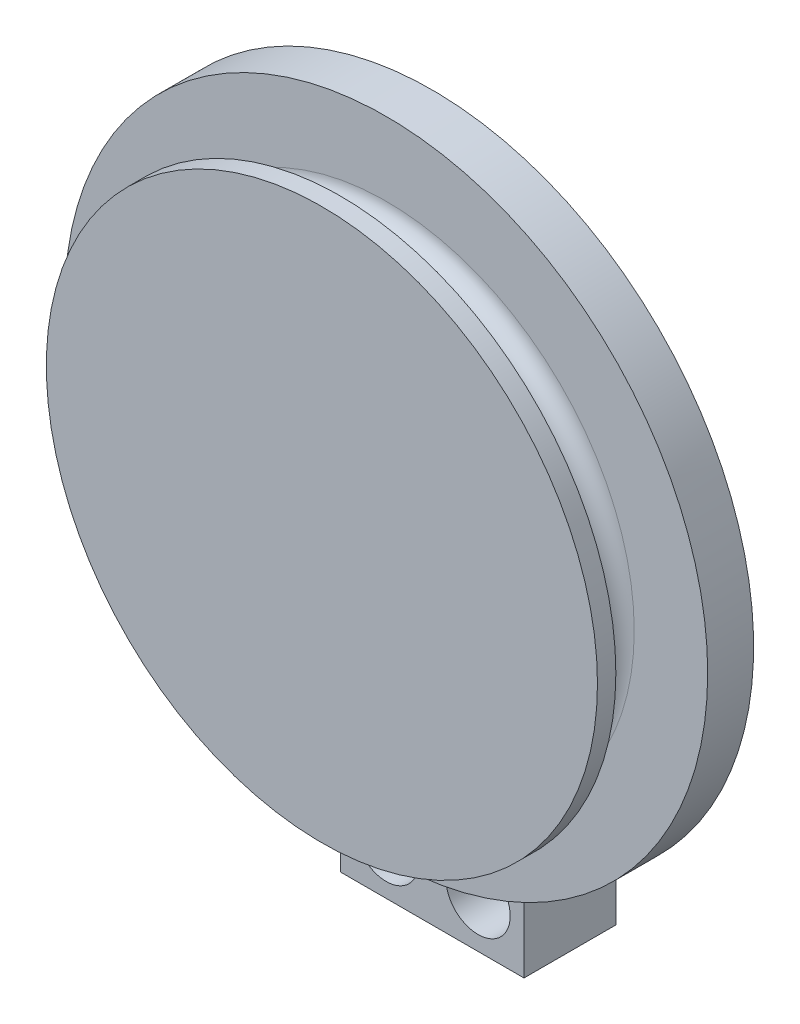
ISO-10303-21;
HEADER;
FILE_DESCRIPTION(('STEP AP214'),'2;1');
FILE_NAME('part.step','',(''),(''),'','','');
FILE_SCHEMA(('AUTOMOTIVE_DESIGN { 1 0 10303 214 1 1 1 1 }'));
ENDSEC;
DATA;
#1=APPLICATION_CONTEXT('core data for automotive mechanical design processes');
#2=APPLICATION_PROTOCOL_DEFINITION('international standard','automotive_design',2000,#1);
#3=PRODUCT_CONTEXT('',#1,'mechanical');
#4=PRODUCT('Part','Part','',(#3));
#5=PRODUCT_RELATED_PRODUCT_CATEGORY('part','',(#4));
#6=PRODUCT_DEFINITION_FORMATION('','',#4);
#7=PRODUCT_DEFINITION_CONTEXT('part definition',#1,'design');
#8=PRODUCT_DEFINITION('design','',#6,#7);
#9=PRODUCT_DEFINITION_SHAPE('','',#8);
#10=(LENGTH_UNIT() NAMED_UNIT(*) SI_UNIT(.MILLI.,.METRE.));
#11=(NAMED_UNIT(*) PLANE_ANGLE_UNIT() SI_UNIT($,.RADIAN.));
#12=(NAMED_UNIT(*) SI_UNIT($,.STERADIAN.) SOLID_ANGLE_UNIT());
#13=UNCERTAINTY_MEASURE_WITH_UNIT(LENGTH_MEASURE(1.E-05),#10,'distance_accuracy_value','');
#14=(GEOMETRIC_REPRESENTATION_CONTEXT(3) GLOBAL_UNCERTAINTY_ASSIGNED_CONTEXT((#13)) GLOBAL_UNIT_ASSIGNED_CONTEXT((#10,
#11,#12)) REPRESENTATION_CONTEXT('',''));
#15=CARTESIAN_POINT('',(0.,0.,0.));
#16=DIRECTION('',(0.,0.,1.));
#17=DIRECTION('',(1.,0.,0.));
#18=AXIS2_PLACEMENT_3D('',#15,#16,#17);
#19=CARTESIAN_POINT('',(-5.,-38.6381772685362,21.));
#20=DIRECTION('',(0.,0.,-1.));
#21=DIRECTION('',(-1.,0.,0.));
#22=AXIS2_PLACEMENT_3D('',#19,#20,#21);
#23=CYLINDRICAL_SURFACE('',#22,1.75);
#24=CARTESIAN_POINT('',(-5.,-38.6381772685362,-1.));
#25=DIRECTION('',(0.,0.,-1.));
#26=DIRECTION('',(-1.,0.,0.));
#27=AXIS2_PLACEMENT_3D('',#24,#25,#26);
#28=CIRCLE('',#27,1.75);
#29=CARTESIAN_POINT('',(-6.75,-38.6381772685362,-1.));
#30=VERTEX_POINT('',#29);
#31=EDGE_CURVE('E313',#30,#30,#28,.T.);
#32=ORIENTED_EDGE('',*,*,#31,.T.);
#33=EDGE_LOOP('',(#32));
#34=FACE_BOUND('',#33,.T.);
#35=CARTESIAN_POINT('',(-5.,-38.6381772685362,3.));
#36=DIRECTION('',(0.,0.,1.));
#37=DIRECTION('',(1.,0.,0.));
#38=AXIS2_PLACEMENT_3D('',#35,#36,#37);
#39=CIRCLE('',#38,1.75);
#40=CARTESIAN_POINT('',(-3.25,-38.6381772685362,3.));
#41=VERTEX_POINT('',#40);
#42=EDGE_CURVE('E38',#41,#41,#39,.F.);
#43=ORIENTED_EDGE('',*,*,#42,.F.);
#44=EDGE_LOOP('',(#43));
#45=FACE_BOUND('',#44,.T.);
#46=ADVANCED_FACE('F33',(#34,#45),#23,.F.);
#47=CARTESIAN_POINT('',(5.,-38.6381772685362,21.));
#48=DIRECTION('',(0.,0.,-1.));
#49=DIRECTION('',(-1.,0.,0.));
#50=AXIS2_PLACEMENT_3D('',#47,#48,#49);
#51=CYLINDRICAL_SURFACE('',#50,1.75);
#52=CARTESIAN_POINT('',(5.,-38.6381772685362,-1.));
#53=DIRECTION('',(0.,0.,-1.));
#54=DIRECTION('',(-1.,0.,0.));
#55=AXIS2_PLACEMENT_3D('',#52,#53,#54);
#56=CIRCLE('',#55,1.75);
#57=CARTESIAN_POINT('',(3.25,-38.6381772685362,-1.));
#58=VERTEX_POINT('',#57);
#59=EDGE_CURVE('E358',#58,#58,#56,.T.);
#60=ORIENTED_EDGE('',*,*,#59,.T.);
#61=EDGE_LOOP('',(#60));
#62=FACE_BOUND('',#61,.T.);
#63=CARTESIAN_POINT('',(5.,-38.6381772685362,3.));
#64=DIRECTION('',(0.,0.,1.));
#65=DIRECTION('',(1.,0.,0.));
#66=AXIS2_PLACEMENT_3D('',#63,#64,#65);
#67=CIRCLE('',#66,1.75);
#68=CARTESIAN_POINT('',(6.75,-38.6381772685362,3.));
#69=VERTEX_POINT('',#68);
#70=EDGE_CURVE('E325',#69,#69,#67,.F.);
#71=ORIENTED_EDGE('',*,*,#70,.F.);
#72=EDGE_LOOP('',(#71));
#73=FACE_BOUND('',#72,.T.);
#74=ADVANCED_FACE('F242',(#62,#73),#51,.F.);
#75=CARTESIAN_POINT('',(0.,0.,9.));
#76=DIRECTION('',(0.,0.,1.));
#77=DIRECTION('',(1.,0.,0.));
#78=AXIS2_PLACEMENT_3D('',#75,#76,#77);
#79=PLANE('',#78);
#80=CARTESIAN_POINT('',(0.,0.,9.));
#81=DIRECTION('',(0.,0.,1.));
#82=DIRECTION('',(1.,0.,0.));
#83=AXIS2_PLACEMENT_3D('',#80,#81,#82);
#84=CIRCLE('',#83,6.25);
#85=CARTESIAN_POINT('',(6.25,0.,9.));
#86=VERTEX_POINT('',#85);
#87=EDGE_CURVE('E378',#86,#86,#84,.T.);
#88=ORIENTED_EDGE('',*,*,#87,.T.);
#89=EDGE_LOOP('',(#88));
#90=FACE_BOUND('',#89,.T.);
#91=DIRECTION('',(1.,0.,0.));
#92=VECTOR('',#91,1.);
#93=CARTESIAN_POINT('',(-35.,0.,9.));
#94=LINE('',#93,#92);
#95=CARTESIAN_POINT('',(-35.,0.,9.));
#96=VERTEX_POINT('',#95);
#97=CARTESIAN_POINT('',(-27.,0.,9.));
#98=VERTEX_POINT('',#97);
#99=EDGE_CURVE('E293',#96,#98,#94,.T.);
#100=ORIENTED_EDGE('',*,*,#99,.F.);
#101=CARTESIAN_POINT('',(0.,0.,9.));
#102=DIRECTION('',(0.,0.,1.));
#103=DIRECTION('',(1.,0.,0.));
#104=AXIS2_PLACEMENT_3D('',#101,#102,#103);
#105=CIRCLE('',#104,35.);
#106=CARTESIAN_POINT('',(10.,-33.5410196624969,9.));
#107=VERTEX_POINT('',#106);
#108=EDGE_CURVE('E138',#107,#96,#105,.T.);
#109=ORIENTED_EDGE('',*,*,#108,.F.);
#110=DIRECTION('',(0.,-1.,0.));
#111=VECTOR('',#110,1.);
#112=CARTESIAN_POINT('',(10.,-25.0798724079689,9.));
#113=LINE('',#112,#111);
#114=CARTESIAN_POINT('',(10.,-25.0798724079689,9.));
#115=VERTEX_POINT('',#114);
#116=EDGE_CURVE('E56',#115,#107,#113,.T.);
#117=ORIENTED_EDGE('',*,*,#116,.F.);
#118=CARTESIAN_POINT('',(0.,0.,9.));
#119=DIRECTION('',(0.,0.,1.));
#120=DIRECTION('',(-1.,0.,0.));
#121=AXIS2_PLACEMENT_3D('',#118,#119,#120);
#122=CIRCLE('',#121,27.);
#123=EDGE_CURVE('E51',#98,#115,#122,.T.);
#124=ORIENTED_EDGE('',*,*,#123,.F.);
#125=EDGE_LOOP('',(#100,#109,#117,#124));
#126=FACE_BOUND('',#125,.T.);
#127=ADVANCED_FACE('F240',(#90,#126),#79,.F.);
#128=CARTESIAN_POINT('',(0.,0.,19.));
#129=DIRECTION('',(0.,0.,-1.));
#130=DIRECTION('',(-1.,0.,0.));
#131=AXIS2_PLACEMENT_3D('',#128,#129,#130);
#132=CYLINDRICAL_SURFACE('',#131,25.);
#133=CARTESIAN_POINT('',(0.,0.,17.));
#134=DIRECTION('',(0.,0.,1.));
#135=DIRECTION('',(1.,0.,0.));
#136=AXIS2_PLACEMENT_3D('',#133,#134,#135);
#137=CIRCLE('',#136,25.);
#138=CARTESIAN_POINT('',(1.42285988544555,24.9594765519309,17.));
#139=VERTEX_POINT('',#138);
#140=CARTESIAN_POINT('',(1.42285988544555,-24.9594765519309,17.));
#141=VERTEX_POINT('',#140);
#142=EDGE_CURVE('E393',#139,#141,#137,.F.);
#143=ORIENTED_EDGE('',*,*,#142,.T.);
#144=CARTESIAN_POINT('',(1.42285988544555,-24.9594765519309,17.));
#145=CARTESIAN_POINT('',(1.43709694327065,-24.9586644030287,16.9597341039124));
#146=CARTESIAN_POINT('',(1.44960646372834,-24.9579396577293,16.9188748216169));
#147=CARTESIAN_POINT('',(1.47109830540468,-24.9566822846817,16.836239768369));
#148=CARTESIAN_POINT('',(1.48008092678776,-24.9561496405848,16.7944640757293));
#149=CARTESIAN_POINT('',(1.50122110227948,-24.9548902014337,16.6705739593089));
#150=CARTESIAN_POINT('',(1.5083903417906,-24.9544536508322,16.5875537152397));
#151=CARTESIAN_POINT('',(1.50889312423618,-24.9544233205322,16.4200067063181));
#152=CARTESIAN_POINT('',(1.50198164799829,-24.9548444655901,16.3354790719246));
#153=CARTESIAN_POINT('',(1.48085640756052,-24.9561036179267,16.2093215945543));
#154=CARTESIAN_POINT('',(1.47180930042457,-24.9566404247026,16.1667673690737));
#155=CARTESIAN_POINT('',(1.45005847503599,-24.9579134519568,16.0826040156588));
#156=CARTESIAN_POINT('',(1.43735452318072,-24.9586496851745,16.0409949482853));
#157=CARTESIAN_POINT('',(1.42285988544555,-24.9594765519309,16.));
#158=B_SPLINE_CURVE_WITH_KNOTS('',3,(#144,#145,#146,#147,#148,#149,#150,#151,#152,#153,#154,
#155,#156,#157),.UNSPECIFIED.,.F.,.F.,(4,2,2,2,2,2,4),(0.,0.128074424957378,0.256137947498022,
0.504914091980192,0.758056161619229,0.888437062160874,1.01882629340442),.UNSPECIFIED.);
#159=CARTESIAN_POINT('',(1.42285988544555,-24.9594765519309,16.));
#160=VERTEX_POINT('',#159);
#161=EDGE_CURVE('E142',#141,#160,#158,.T.);
#162=ORIENTED_EDGE('',*,*,#161,.T.);
#163=CARTESIAN_POINT('',(0.,0.,16.));
#164=DIRECTION('',(0.,0.,1.));
#165=DIRECTION('',(1.,0.,0.));
#166=AXIS2_PLACEMENT_3D('',#163,#164,#165);
#167=CIRCLE('',#166,25.);
#168=CARTESIAN_POINT('',(1.42285988544555,24.9594765519309,16.));
#169=VERTEX_POINT('',#168);
#170=EDGE_CURVE('E397',#160,#169,#167,.T.);
#171=ORIENTED_EDGE('',*,*,#170,.T.);
#172=CARTESIAN_POINT('',(1.42285988544555,24.9594765519309,16.));
#173=CARTESIAN_POINT('',(1.43709694327065,24.9586644030287,16.0402658960876));
#174=CARTESIAN_POINT('',(1.44960646372834,24.9579396577293,16.0811251783831));
#175=CARTESIAN_POINT('',(1.47109830540468,24.9566822846817,16.163760231631));
#176=CARTESIAN_POINT('',(1.48008092678776,24.9561496405848,16.2055359242707));
#177=CARTESIAN_POINT('',(1.50122110227948,24.9548902014337,16.3294260406911));
#178=CARTESIAN_POINT('',(1.5083903417906,24.9544536508322,16.4124462847603));
#179=CARTESIAN_POINT('',(1.50889312423618,24.9544233205322,16.5799932936819));
#180=CARTESIAN_POINT('',(1.50198164799829,24.9548444655901,16.6645209280754));
#181=CARTESIAN_POINT('',(1.48085640756052,24.9561036179267,16.7906784054457));
#182=CARTESIAN_POINT('',(1.47180930042457,24.9566404247026,16.8332326309263));
#183=CARTESIAN_POINT('',(1.45005847503599,24.9579134519568,16.9173959843412));
#184=CARTESIAN_POINT('',(1.43735452318072,24.9586496851745,16.9590050517147));
#185=CARTESIAN_POINT('',(1.42285988544555,24.9594765519309,17.));
#186=B_SPLINE_CURVE_WITH_KNOTS('',3,(#172,#173,#174,#175,#176,#177,#178,#179,#180,#181,#182,
#183,#184,#185),.UNSPECIFIED.,.F.,.F.,(4,2,2,2,2,2,4),(0.,0.128074424957378,0.256137947498022,
0.504914091980192,0.758056161619229,0.888437062160874,1.01882629340442),.UNSPECIFIED.);
#187=EDGE_CURVE('E193',#169,#139,#186,.T.);
#188=ORIENTED_EDGE('',*,*,#187,.T.);
#189=EDGE_LOOP('',(#143,#162,#171,#188));
#190=FACE_BOUND('',#189,.T.);
#191=ADVANCED_FACE('F223',(#190),#132,.T.);
#192=CARTESIAN_POINT('',(0.,0.,7.));
#193=DIRECTION('',(0.,0.,-1.));
#194=DIRECTION('',(-1.,0.,0.));
#195=AXIS2_PLACEMENT_3D('',#192,#193,#194);
#196=CYLINDRICAL_SURFACE('',#195,4.1);
#197=CARTESIAN_POINT('',(0.,0.,7.));
#198=DIRECTION('',(0.,0.,1.));
#199=DIRECTION('',(1.,0.,0.));
#200=AXIS2_PLACEMENT_3D('',#197,#198,#199);
#201=CIRCLE('',#200,4.1);
#202=CARTESIAN_POINT('',(4.1,0.,7.));
#203=VERTEX_POINT('',#202);
#204=EDGE_CURVE('E385',#203,#203,#201,.T.);
#205=ORIENTED_EDGE('',*,*,#204,.F.);
#206=EDGE_LOOP('',(#205));
#207=FACE_BOUND('',#206,.T.);
#208=CARTESIAN_POINT('',(0.,0.,0.));
#209=DIRECTION('',(0.,0.,1.));
#210=DIRECTION('',(1.,0.,0.));
#211=AXIS2_PLACEMENT_3D('',#208,#209,#210);
#212=CIRCLE('',#211,4.1);
#213=CARTESIAN_POINT('',(4.1,0.,0.));
#214=VERTEX_POINT('',#213);
#215=EDGE_CURVE('E381',#214,#214,#212,.T.);
#216=ORIENTED_EDGE('',*,*,#215,.T.);
#217=EDGE_LOOP('',(#216));
#218=FACE_BOUND('',#217,.T.);
#219=ADVANCED_FACE('F218',(#207,#218),#196,.T.);
#220=CARTESIAN_POINT('',(0.,0.,0.));
#221=DIRECTION('',(0.,0.,1.));
#222=DIRECTION('',(1.,0.,0.));
#223=AXIS2_PLACEMENT_3D('',#220,#221,#222);
#224=PLANE('',#223);
#225=ORIENTED_EDGE('',*,*,#215,.F.);
#226=EDGE_LOOP('',(#225));
#227=FACE_BOUND('',#226,.T.);
#228=ADVANCED_FACE('F222',(#227),#224,.F.);
#229=CARTESIAN_POINT('',(0.,0.,9.));
#230=DIRECTION('',(0.,0.,-1.));
#231=DIRECTION('',(-1.,0.,0.));
#232=AXIS2_PLACEMENT_3D('',#229,#230,#231);
#233=CYLINDRICAL_SURFACE('',#232,6.25);
#234=ORIENTED_EDGE('',*,*,#87,.F.);
#235=EDGE_LOOP('',(#234));
#236=FACE_BOUND('',#235,.T.);
#237=CARTESIAN_POINT('',(0.,0.,7.));
#238=DIRECTION('',(0.,0.,1.));
#239=DIRECTION('',(1.,0.,0.));
#240=AXIS2_PLACEMENT_3D('',#237,#238,#239);
#241=CIRCLE('',#240,6.25);
#242=CARTESIAN_POINT('',(6.25,0.,7.));
#243=VERTEX_POINT('',#242);
#244=EDGE_CURVE('E382',#243,#243,#241,.T.);
#245=ORIENTED_EDGE('',*,*,#244,.T.);
#246=EDGE_LOOP('',(#245));
#247=FACE_BOUND('',#246,.T.);
#248=ADVANCED_FACE('F227',(#236,#247),#233,.T.);
#249=CARTESIAN_POINT('',(0.,0.,7.));
#250=DIRECTION('',(0.,0.,1.));
#251=DIRECTION('',(1.,0.,0.));
#252=AXIS2_PLACEMENT_3D('',#249,#250,#251);
#253=PLANE('',#252);
#254=ORIENTED_EDGE('',*,*,#204,.T.);
#255=EDGE_LOOP('',(#254));
#256=FACE_BOUND('',#255,.T.);
#257=ORIENTED_EDGE('',*,*,#244,.F.);
#258=EDGE_LOOP('',(#257));
#259=FACE_BOUND('',#258,.T.);
#260=ADVANCED_FACE('F231',(#256,#259),#253,.F.);
#261=CARTESIAN_POINT('',(0.,0.,14.));
#262=DIRECTION('',(0.,0.,-1.));
#263=DIRECTION('',(-1.,0.,0.));
#264=AXIS2_PLACEMENT_3D('',#261,#262,#263);
#265=CYLINDRICAL_SURFACE('',#264,35.);
#266=CARTESIAN_POINT('',(0.,0.,14.));
#267=DIRECTION('',(0.,0.,1.));
#268=DIRECTION('',(1.,0.,0.));
#269=AXIS2_PLACEMENT_3D('',#266,#267,#268);
#270=CIRCLE('',#269,35.);
#271=CARTESIAN_POINT('',(35.,0.,14.));
#272=VERTEX_POINT('',#271);
#273=EDGE_CURVE('E373',#272,#272,#270,.T.);
#274=ORIENTED_EDGE('',*,*,#273,.F.);
#275=EDGE_LOOP('',(#274));
#276=FACE_BOUND('',#275,.T.);
#277=ORIENTED_EDGE('',*,*,#108,.T.);
#278=DIRECTION('',(0.,0.,1.));
#279=VECTOR('',#278,1.);
#280=CARTESIAN_POINT('',(-35.,0.,-0.999999999999999));
#281=LINE('',#280,#279);
#282=CARTESIAN_POINT('',(-35.,0.,-0.999999999999999));
#283=VERTEX_POINT('',#282);
#284=EDGE_CURVE('E119',#283,#96,#281,.T.);
#285=ORIENTED_EDGE('',*,*,#284,.F.);
#286=CARTESIAN_POINT('',(0.,0.,-0.999999999999999));
#287=DIRECTION('',(0.,0.,-1.));
#288=DIRECTION('',(-1.,0.,0.));
#289=AXIS2_PLACEMENT_3D('',#286,#287,#288);
#290=CIRCLE('',#289,35.);
#291=CARTESIAN_POINT('',(-10.,-33.5410196624969,-0.999999999999999));
#292=VERTEX_POINT('',#291);
#293=EDGE_CURVE('E125',#292,#283,#290,.T.);
#294=ORIENTED_EDGE('',*,*,#293,.F.);
#295=DIRECTION('',(0.,0.,1.));
#296=VECTOR('',#295,1.);
#297=CARTESIAN_POINT('',(-10.,-33.5410196624969,-0.999999999999999));
#298=LINE('',#297,#296);
#299=CARTESIAN_POINT('',(-10.,-33.5410196624969,9.));
#300=VERTEX_POINT('',#299);
#301=EDGE_CURVE('E304',#292,#300,#298,.T.);
#302=ORIENTED_EDGE('',*,*,#301,.T.);
#303=EDGE_CURVE('E370',#300,#107,#105,.T.);
#304=ORIENTED_EDGE('',*,*,#303,.T.);
#305=EDGE_LOOP('',(#277,#285,#294,#302,#304));
#306=FACE_BOUND('',#305,.T.);
#307=ADVANCED_FACE('F137',(#276,#306),#265,.T.);
#308=CARTESIAN_POINT('',(0.,0.,14.));
#309=DIRECTION('',(0.,0.,1.));
#310=DIRECTION('',(1.,0.,0.));
#311=AXIS2_PLACEMENT_3D('',#308,#309,#310);
#312=PLANE('',#311);
#313=CARTESIAN_POINT('',(0.,0.,14.));
#314=DIRECTION('',(0.,0.,1.));
#315=DIRECTION('',(1.,0.,0.));
#316=AXIS2_PLACEMENT_3D('',#313,#314,#315);
#317=CIRCLE('',#316,27.);
#318=CARTESIAN_POINT('',(27.,0.,14.));
#319=VERTEX_POINT('',#318);
#320=EDGE_CURVE('E400',#319,#319,#317,.F.);
#321=ORIENTED_EDGE('',*,*,#320,.T.);
#322=EDGE_LOOP('',(#321));
#323=FACE_BOUND('',#322,.T.);
#324=ORIENTED_EDGE('',*,*,#273,.T.);
#325=EDGE_LOOP('',(#324));
#326=FACE_BOUND('',#325,.T.);
#327=ADVANCED_FACE('F238',(#323,#326),#312,.T.);
#328=CARTESIAN_POINT('',(-1.40556723930064,-24.9604563406963,17.));
#329=VERTEX_POINT('',#328);
#330=CARTESIAN_POINT('',(-1.40556723930064,24.9604563406963,17.));
#331=VERTEX_POINT('',#330);
#332=EDGE_CURVE('E396',#329,#331,#137,.F.);
#333=ORIENTED_EDGE('',*,*,#332,.T.);
#334=CARTESIAN_POINT('',(-1.40556723930064,24.9604563406963,17.));
#335=CARTESIAN_POINT('',(-1.41980487103239,24.9596540547445,16.9597324779812));
#336=CARTESIAN_POINT('',(-1.43231481261331,24.9589379808545,16.9188715652109));
#337=CARTESIAN_POINT('',(-1.45380720366565,24.957695516502,16.8362332605887));
#338=CARTESIAN_POINT('',(-1.462789953484,24.9571691098893,16.7944559470899));
#339=CARTESIAN_POINT('',(-1.48393011300849,24.9559243701601,16.6705610014197));
#340=CARTESIAN_POINT('',(-1.49109880562506,24.9554928381129,16.5875375797939));
#341=CARTESIAN_POINT('',(-1.49159944617271,24.9554629851869,16.419990630566));
#342=CARTESIAN_POINT('',(-1.48468741844627,24.9558793558143,16.3354662408866));
#343=CARTESIAN_POINT('',(-1.46356213000763,24.9571238202395,16.2093135944511));
#344=CARTESIAN_POINT('',(-1.45451516963702,24.9576543270809,16.1667610666979));
#345=CARTESIAN_POINT('',(-1.43276489879871,24.9589121995704,16.0826009742226));
#346=CARTESIAN_POINT('',(-1.42006135424305,24.9596395778217,16.0409934701832));
#347=CARTESIAN_POINT('',(-1.40556723930065,24.9604563406963,16.));
#348=B_SPLINE_CURVE_WITH_KNOTS('',3,(#334,#335,#336,#337,#338,#339,#340,#341,#342,#343,#344,
#345,#346,#347),.UNSPECIFIED.,.F.,.F.,(4,2,2,2,2,2,4),(0.,0.128079028371411,0.256147148209057,
0.504932513805586,0.758065216469923,0.888440837240595,1.01882480628174),.UNSPECIFIED.);
#349=CARTESIAN_POINT('',(-1.40556723930064,24.9604563406963,16.));
#350=VERTEX_POINT('',#349);
#351=EDGE_CURVE('E198',#331,#350,#348,.T.);
#352=ORIENTED_EDGE('',*,*,#351,.T.);
#353=CARTESIAN_POINT('',(-1.40556723930064,-24.9604563406963,16.));
#354=VERTEX_POINT('',#353);
#355=EDGE_CURVE('E399',#350,#354,#167,.T.);
#356=ORIENTED_EDGE('',*,*,#355,.T.);
#357=CARTESIAN_POINT('',(-1.40556723930064,-24.9604563406963,16.));
#358=CARTESIAN_POINT('',(-1.41980487103239,-24.9596540547445,16.0402675220188));
#359=CARTESIAN_POINT('',(-1.43231481261331,-24.9589379808545,16.0811284347891));
#360=CARTESIAN_POINT('',(-1.45380720366565,-24.957695516502,16.1637667394113));
#361=CARTESIAN_POINT('',(-1.462789953484,-24.9571691098893,16.2055440529101));
#362=CARTESIAN_POINT('',(-1.48393011300849,-24.9559243701601,16.3294389985803));
#363=CARTESIAN_POINT('',(-1.49109880562506,-24.9554928381129,16.4124624202061));
#364=CARTESIAN_POINT('',(-1.49159944617271,-24.9554629851869,16.580009369434));
#365=CARTESIAN_POINT('',(-1.48468741844627,-24.9558793558143,16.6645337591134));
#366=CARTESIAN_POINT('',(-1.46356213000763,-24.9571238202395,16.7906864055489));
#367=CARTESIAN_POINT('',(-1.45451516963702,-24.9576543270809,16.8332389333021));
#368=CARTESIAN_POINT('',(-1.43276489879871,-24.9589121995704,16.9173990257774));
#369=CARTESIAN_POINT('',(-1.42006135424305,-24.9596395778217,16.9590065298168));
#370=CARTESIAN_POINT('',(-1.40556723930065,-24.9604563406963,17.));
#371=B_SPLINE_CURVE_WITH_KNOTS('',3,(#357,#358,#359,#360,#361,#362,#363,#364,#365,#366,#367,
#368,#369,#370),.UNSPECIFIED.,.F.,.F.,(4,2,2,2,2,2,4),(0.,0.128079028371411,0.256147148209057,
0.504932513805586,0.758065216469923,0.888440837240595,1.01882480628174),.UNSPECIFIED.);
#372=EDGE_CURVE('E139',#354,#329,#371,.T.);
#373=ORIENTED_EDGE('',*,*,#372,.T.);
#374=EDGE_LOOP('',(#333,#352,#356,#373));
#375=FACE_BOUND('',#374,.T.);
#376=ADVANCED_FACE('F157',(#375),#132,.T.);
#377=CARTESIAN_POINT('',(0.,0.,21.));
#378=DIRECTION('',(0.,0.,-1.));
#379=DIRECTION('',(-1.,0.,0.));
#380=AXIS2_PLACEMENT_3D('',#377,#378,#379);
#381=CYLINDRICAL_SURFACE('',#380,30.);
#382=CARTESIAN_POINT('',(0.,0.,21.));
#383=DIRECTION('',(0.,0.,1.));
#384=DIRECTION('',(1.,0.,0.));
#385=AXIS2_PLACEMENT_3D('',#382,#383,#384);
#386=CIRCLE('',#385,30.);
#387=CARTESIAN_POINT('',(30.,0.,21.));
#388=VERTEX_POINT('',#387);
#389=EDGE_CURVE('E210',#388,#388,#386,.T.);
#390=ORIENTED_EDGE('',*,*,#389,.F.);
#391=EDGE_LOOP('',(#390));
#392=FACE_BOUND('',#391,.T.);
#393=CARTESIAN_POINT('',(0.,0.,19.));
#394=DIRECTION('',(0.,0.,1.));
#395=DIRECTION('',(1.,0.,0.));
#396=AXIS2_PLACEMENT_3D('',#393,#394,#395);
#397=CIRCLE('',#396,30.);
#398=CARTESIAN_POINT('',(30.,0.,19.));
#399=VERTEX_POINT('',#398);
#400=EDGE_CURVE('E209',#399,#399,#397,.T.);
#401=ORIENTED_EDGE('',*,*,#400,.T.);
#402=EDGE_LOOP('',(#401));
#403=FACE_BOUND('',#402,.T.);
#404=ADVANCED_FACE('F249',(#392,#403),#381,.T.);
#405=CARTESIAN_POINT('',(0.,0.,21.));
#406=DIRECTION('',(0.,0.,1.));
#407=DIRECTION('',(1.,0.,0.));
#408=AXIS2_PLACEMENT_3D('',#405,#406,#407);
#409=PLANE('',#408);
#410=ORIENTED_EDGE('',*,*,#389,.T.);
#411=EDGE_LOOP('',(#410));
#412=FACE_BOUND('',#411,.T.);
#413=ADVANCED_FACE('F169',(#412),#409,.T.);
#414=CARTESIAN_POINT('',(0.,0.,19.));
#415=DIRECTION('',(0.,0.,1.));
#416=DIRECTION('',(1.,0.,0.));
#417=AXIS2_PLACEMENT_3D('',#414,#415,#416);
#418=PLANE('',#417);
#419=CARTESIAN_POINT('',(0.,0.,19.));
#420=DIRECTION('',(0.,0.,1.));
#421=DIRECTION('',(1.,0.,0.));
#422=AXIS2_PLACEMENT_3D('',#419,#420,#421);
#423=CIRCLE('',#422,27.);
#424=CARTESIAN_POINT('',(27.,0.,19.));
#425=VERTEX_POINT('',#424);
#426=EDGE_CURVE('E388',#425,#425,#423,.T.);
#427=ORIENTED_EDGE('',*,*,#426,.T.);
#428=EDGE_LOOP('',(#427));
#429=FACE_BOUND('',#428,.T.);
#430=ORIENTED_EDGE('',*,*,#400,.F.);
#431=EDGE_LOOP('',(#430));
#432=FACE_BOUND('',#431,.T.);
#433=ADVANCED_FACE('F216',(#429,#432),#418,.F.);
#434=CARTESIAN_POINT('',(0.,0.,17.));
#435=DIRECTION('',(0.,0.,1.));
#436=DIRECTION('',(1.,0.,0.));
#437=AXIS2_PLACEMENT_3D('',#434,#435,#436);
#438=TOROIDAL_SURFACE('',#437,27.,2.);
#439=ORIENTED_EDGE('',*,*,#142,.F.);
#440=CARTESIAN_POINT('',(1.42293058021456,24.9594725317642,16.9998));
#441=CARTESIAN_POINT('',(1.40970210104214,24.9602183631778,17.0372441134571));
#442=CARTESIAN_POINT('',(1.3949971730751,24.9621006815483,17.0741081393637));
#443=CARTESIAN_POINT('',(1.36280367221689,24.967878034684,17.1463896346851));
#444=CARTESIAN_POINT('',(1.34531822302628,24.9717708217451,17.1818086719818));
#445=CARTESIAN_POINT('',(1.28918109824361,24.986009523131,17.2850670838243));
#446=CARTESIAN_POINT('',(1.24664269682068,24.9989351458626,17.3504839676523));
#447=CARTESIAN_POINT('',(1.15285116389514,25.0292394298734,17.4730064566764));
#448=CARTESIAN_POINT('',(1.1016328171039,25.0466004520703,17.5301436104085));
#449=CARTESIAN_POINT('',(0.991399795396595,25.0834232758059,17.6357981298714));
#450=CARTESIAN_POINT('',(0.932366467023351,25.1028900826137,17.6842941993736));
#451=CARTESIAN_POINT('',(0.800646020876461,25.1435802236095,17.7766764024749));
#452=CARTESIAN_POINT('',(0.727171128233709,25.1647606011214,17.8194648567098));
#453=CARTESIAN_POINT('',(0.573228581936528,25.2032262424462,17.8922940342279));
#454=CARTESIAN_POINT('',(0.492767093461546,25.2205148929904,17.9223458616813));
#455=CARTESIAN_POINT('',(0.328143713340529,25.2476813603062,17.9680175486474));
#456=CARTESIAN_POINT('',(0.244072879181283,25.2576852982171,17.9838841582065));
#457=CARTESIAN_POINT('',(0.0739130320510732,25.2685340144098,18.0010084051535));
#458=CARTESIAN_POINT('',(-0.0121732589879729,25.2693905037935,18.00228472204));
#459=CARTESIAN_POINT('',(-0.170218052918519,25.2623611717665,17.9910877763795));
#460=CARTESIAN_POINT('',(-0.242388979653839,25.2557450834349,17.9806130387518));
#461=CARTESIAN_POINT('',(-0.383761471143748,25.2368904135293,17.9495714236164));
#462=CARTESIAN_POINT('',(-0.45296157861562,25.2246491062962,17.928999653335));
#463=CARTESIAN_POINT('',(-0.58929328232316,25.195831503044,17.8776648322346));
#464=CARTESIAN_POINT('',(-0.656272336464497,25.179120826961,17.8465761925562));
#465=CARTESIAN_POINT('',(-0.784632751659387,25.1437707751264,17.7751902693241));
#466=CARTESIAN_POINT('',(-0.846007890112748,25.1251293032638,17.7348829191879));
#467=CARTESIAN_POINT('',(-0.971369437700396,25.0852385671728,17.6387464965321));
#468=CARTESIAN_POINT('',(-1.03427376551615,25.0640353345722,17.581477703892));
#469=CARTESIAN_POINT('',(-1.14992250287085,25.0253930608732,17.4565229475282));
#470=CARTESIAN_POINT('',(-1.20268987119304,25.0079455026299,17.3888611637336));
#471=CARTESIAN_POINT('',(-1.28137687227125,24.9845499236324,17.2676304746493));
#472=CARTESIAN_POINT('',(-1.31048334808657,24.9767086306066,17.2164848574632));
#473=CARTESIAN_POINT('',(-1.36272672779729,24.9651956295963,17.1106154604324));
#474=CARTESIAN_POINT('',(-1.38584593652139,24.961536174539,17.0558816599761));
#475=CARTESIAN_POINT('',(-1.40563793406966,24.9604523696648,16.9998));
#476=B_SPLINE_CURVE_WITH_KNOTS('',3,(#440,#441,#442,#443,#444,#445,#446,#447,#448,#449,#450,
#451,#452,#453,#454,#455,#456,#457,#458,#459,#460,#461,#462,#463,#464,#465,#466,#467,#468,#469,
#470,#471,#472,#473,#474,#475),.UNSPECIFIED.,.F.,.F.,(4,2,2,2,2,2,2,2,2,2,2,2,2,2,2,2,2,4),(0.,
0.119051718844137,0.237970625067039,0.473999459514225,0.709103861580061,0.944779904363447,
1.2064386329415,1.46786876803685,1.72465752416813,1.98111748475563,2.19978354804733,
2.41855567630466,2.64483743024826,2.87136746757302,3.13317880044132,3.3943899900304,
3.57197388608869,3.75007678550981),.UNSPECIFIED.);
#477=EDGE_CURVE('E203',#139,#331,#476,.T.);
#478=ORIENTED_EDGE('',*,*,#477,.T.);
#479=ORIENTED_EDGE('',*,*,#332,.F.);
#480=CARTESIAN_POINT('',(-1.40563793406966,-24.9604523696648,16.9998));
#481=CARTESIAN_POINT('',(-1.3924083760126,-24.9611890668439,17.0372471542468));
#482=CARTESIAN_POINT('',(-1.37770203240728,-24.9630613750752,17.0741144259161));
#483=CARTESIAN_POINT('',(-1.34550484801191,-24.9688171387448,17.1464028213729));
#484=CARTESIAN_POINT('',(-1.32801712681483,-24.9726983518618,17.1818255101326));
#485=CARTESIAN_POINT('',(-1.27187140465884,-24.9869004877725,17.285095874428));
#486=CARTESIAN_POINT('',(-1.22932513458324,-24.9997991077551,17.3505214075307));
#487=CARTESIAN_POINT('',(-1.13551291792724,-25.0300450311165,17.4730611348378));
#488=CARTESIAN_POINT('',(-1.08428170615771,-25.0473747477606,17.5302068178944));
#489=CARTESIAN_POINT('',(-0.974018638398356,-25.0841300288239,17.6358757675823));
#490=CARTESIAN_POINT('',(-0.914968139350608,-25.1035605811612,17.6843777560785));
#491=CARTESIAN_POINT('',(-0.783222338732005,-25.1441634401432,17.7767578078673));
#492=CARTESIAN_POINT('',(-0.709740608270153,-25.1652921848498,17.819540092252));
#493=CARTESIAN_POINT('',(-0.555786308586552,-25.2036473490704,17.8923548152377));
#494=CARTESIAN_POINT('',(-0.475319927795478,-25.2208771751876,17.9223984042364));
#495=CARTESIAN_POINT('',(-0.31071421561008,-25.247917772635,17.9680460141502));
#496=CARTESIAN_POINT('',(-0.226667159510176,-25.2578565987197,17.9839003983125));
#497=CARTESIAN_POINT('',(-0.0565633564485985,-25.2685792838721,18.0010092959679));
#498=CARTESIAN_POINT('',(0.0294906909860292,-25.2693748015917,18.0022824020722));
#499=CARTESIAN_POINT('',(0.187487715188445,-25.2622400750846,17.9910898871464));
#500=CARTESIAN_POINT('',(0.259643532411051,-25.2555768017257,17.980618668542));
#501=CARTESIAN_POINT('',(0.400984171596375,-25.2366324467092,17.9495895161847));
#502=CARTESIAN_POINT('',(0.470167537154778,-25.2243486447521,17.9290266978127));
#503=CARTESIAN_POINT('',(0.606491234194327,-25.1954437301745,17.877706278058));
#504=CARTESIAN_POINT('',(0.673477403325592,-25.1786869209544,17.846619720658));
#505=CARTESIAN_POINT('',(0.801851602950014,-25.1432470550353,17.7752364892547));
#506=CARTESIAN_POINT('',(0.86323339417507,-25.1245618996536,17.7349297213206));
#507=CARTESIAN_POINT('',(0.988616316697237,-25.0845783226147,17.6387870075558));
#508=CARTESIAN_POINT('',(1.05153455934174,-25.0633265095757,17.5815098240661));
#509=CARTESIAN_POINT('',(1.16720912443276,-25.0245944816213,17.4565317421066));
#510=CARTESIAN_POINT('',(1.21998846872538,-25.0071057110512,17.3888551019818));
#511=CARTESIAN_POINT('',(1.29868089006239,-24.9836539296946,17.2676108445691));
#512=CARTESIAN_POINT('',(1.32778381383234,-24.9757933963982,17.2164700382758));
#513=CARTESIAN_POINT('',(1.38002204021237,-24.9642453123331,17.1106090210107));
#514=CARTESIAN_POINT('',(1.40313960660903,-24.9605700567358,17.0558787607607));
#515=CARTESIAN_POINT('',(1.42293058021456,-24.9594725317642,16.9998));
#516=B_SPLINE_CURVE_WITH_KNOTS('',3,(#480,#481,#482,#483,#484,#485,#486,#487,#488,#489,#490,
#491,#492,#493,#494,#495,#496,#497,#498,#499,#500,#501,#502,#503,#504,#505,#506,#507,#508,#509,
#510,#511,#512,#513,#514,#515),.UNSPECIFIED.,.F.,.F.,(4,2,2,2,2,2,2,2,2,2,2,2,2,2,2,2,2,4),(0.,
0.119060939965303,0.237989270869031,0.474039006533346,0.709166037432646,0.94486411589974,
1.20649319105319,1.46789278266593,1.72458355846718,1.98094699095017,2.19958049302925,
2.41831992442312,2.64464852962099,2.87122610661849,3.13311849938832,3.3944090100571,
3.57198277417778,3.75007686523425),.UNSPECIFIED.);
#517=EDGE_CURVE('E188',#329,#141,#516,.T.);
#518=ORIENTED_EDGE('',*,*,#517,.T.);
#519=EDGE_LOOP('',(#439,#478,#479,#518));
#520=FACE_BOUND('',#519,.T.);
#521=ORIENTED_EDGE('',*,*,#426,.F.);
#522=EDGE_LOOP('',(#521));
#523=FACE_BOUND('',#522,.T.);
#524=ADVANCED_FACE('F212',(#520,#523),#438,.F.);
#525=CARTESIAN_POINT('',(0.,0.,16.));
#526=DIRECTION('',(0.,0.,1.));
#527=DIRECTION('',(1.,0.,0.));
#528=AXIS2_PLACEMENT_3D('',#525,#526,#527);
#529=TOROIDAL_SURFACE('',#528,27.,2.);
#530=ORIENTED_EDGE('',*,*,#320,.F.);
#531=EDGE_LOOP('',(#530));
#532=FACE_BOUND('',#531,.T.);
#533=ORIENTED_EDGE('',*,*,#355,.F.);
#534=CARTESIAN_POINT('',(-1.40563793406966,24.9604523696648,16.0002));
#535=CARTESIAN_POINT('',(-1.3924083760126,24.9611890668439,15.9627528457532));
#536=CARTESIAN_POINT('',(-1.37770203240728,24.9630613750752,15.9258855740839));
#537=CARTESIAN_POINT('',(-1.34550484801191,24.9688171387448,15.8535971786271));
#538=CARTESIAN_POINT('',(-1.32801712681483,24.9726983518618,15.8181744898674));
#539=CARTESIAN_POINT('',(-1.27187140465884,24.9869004877725,15.714904125572));
#540=CARTESIAN_POINT('',(-1.22932513458324,24.9997991077551,15.6494785924693));
#541=CARTESIAN_POINT('',(-1.13551291792724,25.0300450311165,15.5269388651622));
#542=CARTESIAN_POINT('',(-1.08428170615771,25.0473747477606,15.4697931821056));
#543=CARTESIAN_POINT('',(-0.974018638398355,25.0841300288239,15.3641242324177));
#544=CARTESIAN_POINT('',(-0.914968139350609,25.1035605811612,15.3156222439215));
#545=CARTESIAN_POINT('',(-0.783222338732008,25.1441634401432,15.2232421921327));
#546=CARTESIAN_POINT('',(-0.709740608270155,25.1652921848498,15.180459907748));
#547=CARTESIAN_POINT('',(-0.555786308586553,25.2036473490704,15.1076451847623));
#548=CARTESIAN_POINT('',(-0.47531992779548,25.2208771751876,15.0776015957636));
#549=CARTESIAN_POINT('',(-0.310714215610083,25.247917772635,15.0319539858498));
#550=CARTESIAN_POINT('',(-0.226667159510178,25.2578565987197,15.0160996016875));
#551=CARTESIAN_POINT('',(-0.0565633564486014,25.2685792838721,14.9989907040321));
#552=CARTESIAN_POINT('',(0.0294906909860262,25.2693748015917,14.9977175979278));
#553=CARTESIAN_POINT('',(0.187487715188441,25.2622400750846,15.0089101128536));
#554=CARTESIAN_POINT('',(0.259643532411048,25.2555768017257,15.0193813314581));
#555=CARTESIAN_POINT('',(0.400984171596371,25.2366324467092,15.0504104838153));
#556=CARTESIAN_POINT('',(0.470167537154774,25.2243486447521,15.0709733021873));
#557=CARTESIAN_POINT('',(0.606491234194324,25.1954437301745,15.122293721942));
#558=CARTESIAN_POINT('',(0.673477403325589,25.1786869209544,15.1533802793421));
#559=CARTESIAN_POINT('',(0.80185160295001,25.1432470550353,15.2247635107453));
#560=CARTESIAN_POINT('',(0.863233394175066,25.1245618996536,15.2650702786794));
#561=CARTESIAN_POINT('',(0.988616316697233,25.0845783226147,15.3612129924442));
#562=CARTESIAN_POINT('',(1.05153455934173,25.0633265095757,15.4184901759339));
#563=CARTESIAN_POINT('',(1.16720912443275,25.0245944816213,15.5434682578934));
#564=CARTESIAN_POINT('',(1.21998846872537,25.0071057110512,15.6111448980182));
#565=CARTESIAN_POINT('',(1.29868089006239,24.9836539296946,15.7323891554309));
#566=CARTESIAN_POINT('',(1.32778381383234,24.9757933963982,15.7835299617242));
#567=CARTESIAN_POINT('',(1.38002204021237,24.9642453123331,15.8893909789893));
#568=CARTESIAN_POINT('',(1.40313960660903,24.9605700567358,15.9441212392393));
#569=CARTESIAN_POINT('',(1.42293058021456,24.9594725317642,16.0002));
#570=B_SPLINE_CURVE_WITH_KNOTS('',3,(#534,#535,#536,#537,#538,#539,#540,#541,#542,#543,#544,
#545,#546,#547,#548,#549,#550,#551,#552,#553,#554,#555,#556,#557,#558,#559,#560,#561,#562,#563,
#564,#565,#566,#567,#568,#569),.UNSPECIFIED.,.F.,.F.,(4,2,2,2,2,2,2,2,2,2,2,2,2,2,2,2,2,4),(0.,
0.119060939965303,0.237989270869031,0.474039006533344,0.70916603743265,0.94486411589974,
1.20649319105319,1.46789278266593,1.72458355846718,1.98094699095017,2.19958049302925,
2.41831992442312,2.64464852962099,2.87122610661849,3.13311849938831,3.39440901005709,
3.57198277417778,3.75007686523425),.UNSPECIFIED.);
#571=EDGE_CURVE('E11',#350,#169,#570,.T.);
#572=ORIENTED_EDGE('',*,*,#571,.T.);
#573=ORIENTED_EDGE('',*,*,#170,.F.);
#574=CARTESIAN_POINT('',(1.42293058021456,-24.9594725317642,16.0002));
#575=CARTESIAN_POINT('',(1.40970210104214,-24.9602183631778,15.9627558865429));
#576=CARTESIAN_POINT('',(1.3949971730751,-24.9621006815483,15.9258918606363));
#577=CARTESIAN_POINT('',(1.36280367221689,-24.967878034684,15.8536103653149));
#578=CARTESIAN_POINT('',(1.34531822302628,-24.9717708217451,15.8181913280182));
#579=CARTESIAN_POINT('',(1.28918109824361,-24.986009523131,15.7149329161757));
#580=CARTESIAN_POINT('',(1.24664269682068,-24.9989351458626,15.6495160323477));
#581=CARTESIAN_POINT('',(1.15285116389514,-25.0292394298734,15.5269935433236));
#582=CARTESIAN_POINT('',(1.1016328171039,-25.0466004520703,15.4698563895915));
#583=CARTESIAN_POINT('',(0.991399795396592,-25.0834232758059,15.3642018701286));
#584=CARTESIAN_POINT('',(0.93236646702335,-25.1028900826137,15.3157058006264));
#585=CARTESIAN_POINT('',(0.800646020876461,-25.1435802236095,15.2233235975251));
#586=CARTESIAN_POINT('',(0.72717112823371,-25.1647606011214,15.1805351432902));
#587=CARTESIAN_POINT('',(0.573228581936528,-25.2032262424462,15.1077059657721));
#588=CARTESIAN_POINT('',(0.492767093461545,-25.2205148929904,15.0776541383187));
#589=CARTESIAN_POINT('',(0.328143713340526,-25.2476813603062,15.0319824513526));
#590=CARTESIAN_POINT('',(0.24407287918128,-25.2576852982171,15.0161158417935));
#591=CARTESIAN_POINT('',(0.0739130320510699,-25.2685340144098,14.9989915948465));
#592=CARTESIAN_POINT('',(-0.0121732589879764,-25.2693905037935,14.99771527796));
#593=CARTESIAN_POINT('',(-0.170218052918523,-25.2623611717665,15.0089122236205));
#594=CARTESIAN_POINT('',(-0.242388979653843,-25.2557450834349,15.0193869612482));
#595=CARTESIAN_POINT('',(-0.383761471143752,-25.2368904135293,15.0504285763836));
#596=CARTESIAN_POINT('',(-0.452961578615622,-25.2246491062962,15.071000346665));
#597=CARTESIAN_POINT('',(-0.589293282323162,-25.195831503044,15.1223351677655));
#598=CARTESIAN_POINT('',(-0.6562723364645,-25.179120826961,15.1534238074438));
#599=CARTESIAN_POINT('',(-0.784632751659389,-25.1437707751264,15.2248097306759));
#600=CARTESIAN_POINT('',(-0.846007890112751,-25.1251293032638,15.2651170808121));
#601=CARTESIAN_POINT('',(-0.971369437700398,-25.0852385671728,15.3612535034679));
#602=CARTESIAN_POINT('',(-1.03427376551616,-25.0640353345722,15.418522296108));
#603=CARTESIAN_POINT('',(-1.14992250287086,-25.0253930608732,15.5434770524718));
#604=CARTESIAN_POINT('',(-1.20268987119305,-25.0079455026299,15.6111388362664));
#605=CARTESIAN_POINT('',(-1.28137687227125,-24.9845499236324,15.7323695253507));
#606=CARTESIAN_POINT('',(-1.31048334808657,-24.9767086306066,15.7835151425368));
#607=CARTESIAN_POINT('',(-1.36272672779729,-24.9651956295963,15.8893845395676));
#608=CARTESIAN_POINT('',(-1.38584593652139,-24.961536174539,15.944118340024));
#609=CARTESIAN_POINT('',(-1.40563793406966,-24.9604523696648,16.0002));
#610=B_SPLINE_CURVE_WITH_KNOTS('',3,(#574,#575,#576,#577,#578,#579,#580,#581,#582,#583,#584,
#585,#586,#587,#588,#589,#590,#591,#592,#593,#594,#595,#596,#597,#598,#599,#600,#601,#602,#603,
#604,#605,#606,#607,#608,#609),.UNSPECIFIED.,.F.,.F.,(4,2,2,2,2,2,2,2,2,2,2,2,2,2,2,2,2,4),(0.,
0.119051718844137,0.237970625067039,0.473999459514226,0.709103861580066,0.944779904363448,
1.20643863294151,1.46786876803685,1.72465752416813,1.98111748475564,2.19978354804734,
2.41855567630467,2.64483743024826,2.87136746757302,3.13317880044133,3.3943899900304,
3.57197388608869,3.75007678550981),.UNSPECIFIED.);
#611=EDGE_CURVE('E43',#160,#354,#610,.T.);
#612=ORIENTED_EDGE('',*,*,#611,.T.);
#613=EDGE_LOOP('',(#533,#572,#573,#612));
#614=FACE_BOUND('',#613,.T.);
#615=ADVANCED_FACE('F35',(#532,#614),#529,.F.);
#616=CARTESIAN_POINT('',(0.00864632307245059,-35.,16.5));
#617=DIRECTION('',(0.,1.,0.));
#618=DIRECTION('',(0.,0.,1.));
#619=AXIS2_PLACEMENT_3D('',#616,#617,#618);
#620=CYLINDRICAL_SURFACE('',#619,1.5);
#621=ORIENTED_EDGE('',*,*,#372,.F.);
#622=ORIENTED_EDGE('',*,*,#611,.F.);
#623=ORIENTED_EDGE('',*,*,#161,.F.);
#624=ORIENTED_EDGE('',*,*,#517,.F.);
#625=EDGE_LOOP('',(#621,#622,#623,#624));
#626=FACE_BOUND('',#625,.T.);
#627=ORIENTED_EDGE('',*,*,#187,.F.);
#628=ORIENTED_EDGE('',*,*,#571,.F.);
#629=ORIENTED_EDGE('',*,*,#351,.F.);
#630=ORIENTED_EDGE('',*,*,#477,.F.);
#631=EDGE_LOOP('',(#627,#628,#629,#630));
#632=FACE_BOUND('',#631,.T.);
#633=ADVANCED_FACE('F161',(#626,#632),#620,.F.);
#634=CARTESIAN_POINT('',(0.,0.,9.));
#635=DIRECTION('',(0.,0.,-1.));
#636=DIRECTION('',(-1.,0.,0.));
#637=AXIS2_PLACEMENT_3D('',#634,#635,#636);
#638=PLANE('',#637);
#639=CARTESIAN_POINT('',(-5.,-38.6381772685362,9.));
#640=DIRECTION('',(0.,0.,1.));
#641=DIRECTION('',(1.,0.,0.));
#642=AXIS2_PLACEMENT_3D('',#639,#640,#641);
#643=CIRCLE('',#642,3.5);
#644=CARTESIAN_POINT('',(-1.5,-38.6381772685362,9.));
#645=VERTEX_POINT('',#644);
#646=EDGE_CURVE('E326',#645,#645,#643,.T.);
#647=ORIENTED_EDGE('',*,*,#646,.F.);
#648=EDGE_LOOP('',(#647));
#649=FACE_BOUND('',#648,.T.);
#650=CARTESIAN_POINT('',(5.,-38.6381772685362,9.));
#651=DIRECTION('',(0.,0.,1.));
#652=DIRECTION('',(1.,0.,0.));
#653=AXIS2_PLACEMENT_3D('',#650,#651,#652);
#654=CIRCLE('',#653,3.5);
#655=CARTESIAN_POINT('',(8.5,-38.6381772685362,9.));
#656=VERTEX_POINT('',#655);
#657=EDGE_CURVE('E319',#656,#656,#654,.T.);
#658=ORIENTED_EDGE('',*,*,#657,.F.);
#659=EDGE_LOOP('',(#658));
#660=FACE_BOUND('',#659,.T.);
#661=CARTESIAN_POINT('',(9.99999999999999,-43.7353348745756,9.));
#662=VERTEX_POINT('',#661);
#663=EDGE_CURVE('E292',#107,#662,#113,.T.);
#664=ORIENTED_EDGE('',*,*,#663,.F.);
#665=ORIENTED_EDGE('',*,*,#303,.F.);
#666=DIRECTION('',(0.,1.,0.));
#667=VECTOR('',#666,1.);
#668=CARTESIAN_POINT('',(-10.,-33.5410196624969,9.));
#669=LINE('',#668,#667);
#670=CARTESIAN_POINT('',(-10.,-43.7353348745756,9.));
#671=VERTEX_POINT('',#670);
#672=EDGE_CURVE('E134',#671,#300,#669,.T.);
#673=ORIENTED_EDGE('',*,*,#672,.F.);
#674=DIRECTION('',(-1.,0.,0.));
#675=VECTOR('',#674,1.);
#676=CARTESIAN_POINT('',(9.99999999999999,-43.7353348745756,9.));
#677=LINE('',#676,#675);
#678=EDGE_CURVE('E308',#662,#671,#677,.T.);
#679=ORIENTED_EDGE('',*,*,#678,.F.);
#680=EDGE_LOOP('',(#664,#665,#673,#679));
#681=FACE_BOUND('',#680,.T.);
#682=ADVANCED_FACE('F166',(#649,#660,#681),#638,.F.);
#683=CARTESIAN_POINT('',(-35.,0.,-0.999999999999999));
#684=DIRECTION('',(0.,-1.,0.));
#685=DIRECTION('',(0.,0.,-1.));
#686=AXIS2_PLACEMENT_3D('',#683,#684,#685);
#687=PLANE('',#686);
#688=ORIENTED_EDGE('',*,*,#99,.T.);
#689=DIRECTION('',(0.,0.,1.));
#690=VECTOR('',#689,1.);
#691=CARTESIAN_POINT('',(-27.,0.,-0.999999999999999));
#692=LINE('',#691,#690);
#693=CARTESIAN_POINT('',(-27.,0.,-0.999999999999999));
#694=VERTEX_POINT('',#693);
#695=EDGE_CURVE('E121',#694,#98,#692,.T.);
#696=ORIENTED_EDGE('',*,*,#695,.F.);
#697=DIRECTION('',(1.,0.,0.));
#698=VECTOR('',#697,1.);
#699=CARTESIAN_POINT('',(-35.,0.,-0.999999999999999));
#700=LINE('',#699,#698);
#701=EDGE_CURVE('E115',#283,#694,#700,.T.);
#702=ORIENTED_EDGE('',*,*,#701,.F.);
#703=ORIENTED_EDGE('',*,*,#284,.T.);
#704=EDGE_LOOP('',(#688,#696,#702,#703));
#705=FACE_BOUND('',#704,.T.);
#706=ADVANCED_FACE('F117',(#705),#687,.F.);
#707=CARTESIAN_POINT('',(0.,0.,-0.999999999999999));
#708=DIRECTION('',(0.,0.,1.));
#709=DIRECTION('',(1.,0.,0.));
#710=AXIS2_PLACEMENT_3D('',#707,#708,#709);
#711=CYLINDRICAL_SURFACE('',#710,27.);
#712=ORIENTED_EDGE('',*,*,#123,.T.);
#713=DIRECTION('',(0.,0.,1.));
#714=VECTOR('',#713,1.);
#715=CARTESIAN_POINT('',(10.,-25.0798724079689,-0.999999999999999));
#716=LINE('',#715,#714);
#717=CARTESIAN_POINT('',(10.,-25.0798724079689,-0.999999999999999));
#718=VERTEX_POINT('',#717);
#719=EDGE_CURVE('E144',#718,#115,#716,.T.);
#720=ORIENTED_EDGE('',*,*,#719,.F.);
#721=CARTESIAN_POINT('',(0.,0.,-0.999999999999999));
#722=DIRECTION('',(0.,0.,1.));
#723=DIRECTION('',(-1.,0.,0.));
#724=AXIS2_PLACEMENT_3D('',#721,#722,#723);
#725=CIRCLE('',#724,27.);
#726=EDGE_CURVE('E124',#694,#718,#725,.T.);
#727=ORIENTED_EDGE('',*,*,#726,.F.);
#728=ORIENTED_EDGE('',*,*,#695,.T.);
#729=EDGE_LOOP('',(#712,#720,#727,#728));
#730=FACE_BOUND('',#729,.T.);
#731=ADVANCED_FACE('F282',(#730),#711,.F.);
#732=CARTESIAN_POINT('',(10.,-25.0798724079689,-0.999999999999999));
#733=DIRECTION('',(-1.,0.,0.));
#734=DIRECTION('',(0.,-1.,0.));
#735=AXIS2_PLACEMENT_3D('',#732,#733,#734);
#736=PLANE('',#735);
#737=ORIENTED_EDGE('',*,*,#116,.T.);
#738=ORIENTED_EDGE('',*,*,#663,.T.);
#739=DIRECTION('',(0.,0.,1.));
#740=VECTOR('',#739,1.);
#741=CARTESIAN_POINT('',(9.99999999999999,-43.7353348745756,-0.999999999999999));
#742=LINE('',#741,#740);
#743=CARTESIAN_POINT('',(9.99999999999999,-43.7353348745756,-0.999999999999999));
#744=VERTEX_POINT('',#743);
#745=EDGE_CURVE('E297',#744,#662,#742,.T.);
#746=ORIENTED_EDGE('',*,*,#745,.F.);
#747=DIRECTION('',(0.,-1.,0.));
#748=VECTOR('',#747,1.);
#749=CARTESIAN_POINT('',(10.,-25.0798724079689,-0.999999999999999));
#750=LINE('',#749,#748);
#751=EDGE_CURVE('E296',#718,#744,#750,.T.);
#752=ORIENTED_EDGE('',*,*,#751,.F.);
#753=ORIENTED_EDGE('',*,*,#719,.T.);
#754=EDGE_LOOP('',(#737,#738,#746,#752,#753));
#755=FACE_BOUND('',#754,.T.);
#756=ADVANCED_FACE('F279',(#755),#736,.F.);
#757=CARTESIAN_POINT('',(9.99999999999999,-43.7353348745756,-0.999999999999999));
#758=DIRECTION('',(0.,1.,0.));
#759=DIRECTION('',(0.,0.,1.));
#760=AXIS2_PLACEMENT_3D('',#757,#758,#759);
#761=PLANE('',#760);
#762=ORIENTED_EDGE('',*,*,#678,.T.);
#763=DIRECTION('',(0.,0.,1.));
#764=VECTOR('',#763,1.);
#765=CARTESIAN_POINT('',(-10.,-43.7353348745756,-0.999999999999999));
#766=LINE('',#765,#764);
#767=CARTESIAN_POINT('',(-10.,-43.7353348745756,-0.999999999999999));
#768=VERTEX_POINT('',#767);
#769=EDGE_CURVE('E299',#768,#671,#766,.T.);
#770=ORIENTED_EDGE('',*,*,#769,.F.);
#771=DIRECTION('',(-1.,0.,0.));
#772=VECTOR('',#771,1.);
#773=CARTESIAN_POINT('',(9.99999999999999,-43.7353348745756,-0.999999999999999));
#774=LINE('',#773,#772);
#775=EDGE_CURVE('E315',#744,#768,#774,.T.);
#776=ORIENTED_EDGE('',*,*,#775,.F.);
#777=ORIENTED_EDGE('',*,*,#745,.T.);
#778=EDGE_LOOP('',(#762,#770,#776,#777));
#779=FACE_BOUND('',#778,.T.);
#780=ADVANCED_FACE('F275',(#779),#761,.F.);
#781=CARTESIAN_POINT('',(-10.,-33.5410196624969,-0.999999999999999));
#782=DIRECTION('',(1.,0.,0.));
#783=DIRECTION('',(0.,1.,0.));
#784=AXIS2_PLACEMENT_3D('',#781,#782,#783);
#785=PLANE('',#784);
#786=ORIENTED_EDGE('',*,*,#672,.T.);
#787=ORIENTED_EDGE('',*,*,#301,.F.);
#788=DIRECTION('',(0.,1.,0.));
#789=VECTOR('',#788,1.);
#790=CARTESIAN_POINT('',(-10.,-33.7353348745756,-0.999999999999999));
#791=LINE('',#790,#789);
#792=EDGE_CURVE('E130',#768,#292,#791,.T.);
#793=ORIENTED_EDGE('',*,*,#792,.F.);
#794=ORIENTED_EDGE('',*,*,#769,.T.);
#795=EDGE_LOOP('',(#786,#787,#793,#794));
#796=FACE_BOUND('',#795,.T.);
#797=ADVANCED_FACE('F268',(#796),#785,.F.);
#798=CARTESIAN_POINT('',(0.,0.,-0.999999999999999));
#799=DIRECTION('',(0.,0.,-1.));
#800=DIRECTION('',(-1.,0.,0.));
#801=AXIS2_PLACEMENT_3D('',#798,#799,#800);
#802=PLANE('',#801);
#803=ORIENTED_EDGE('',*,*,#59,.F.);
#804=EDGE_LOOP('',(#803));
#805=FACE_BOUND('',#804,.T.);
#806=ORIENTED_EDGE('',*,*,#31,.F.);
#807=EDGE_LOOP('',(#806));
#808=FACE_BOUND('',#807,.T.);
#809=ORIENTED_EDGE('',*,*,#293,.T.);
#810=ORIENTED_EDGE('',*,*,#701,.T.);
#811=ORIENTED_EDGE('',*,*,#726,.T.);
#812=ORIENTED_EDGE('',*,*,#751,.T.);
#813=ORIENTED_EDGE('',*,*,#775,.T.);
#814=ORIENTED_EDGE('',*,*,#792,.T.);
#815=EDGE_LOOP('',(#809,#810,#811,#812,#813,#814));
#816=FACE_BOUND('',#815,.T.);
#817=ADVANCED_FACE('F128',(#805,#808,#816),#802,.T.);
#818=CARTESIAN_POINT('',(5.,-38.6381772685362,3.));
#819=DIRECTION('',(0.,0.,1.));
#820=DIRECTION('',(1.,0.,0.));
#821=AXIS2_PLACEMENT_3D('',#818,#819,#820);
#822=PLANE('',#821);
#823=CARTESIAN_POINT('',(5.,-38.6381772685362,3.));
#824=DIRECTION('',(0.,0.,1.));
#825=DIRECTION('',(1.,0.,0.));
#826=AXIS2_PLACEMENT_3D('',#823,#824,#825);
#827=CIRCLE('',#826,3.5);
#828=CARTESIAN_POINT('',(8.5,-38.6381772685362,3.));
#829=VERTEX_POINT('',#828);
#830=EDGE_CURVE('E322',#829,#829,#827,.T.);
#831=ORIENTED_EDGE('',*,*,#830,.T.);
#832=EDGE_LOOP('',(#831));
#833=FACE_BOUND('',#832,.T.);
#834=ORIENTED_EDGE('',*,*,#70,.T.);
#835=EDGE_LOOP('',(#834));
#836=FACE_BOUND('',#835,.T.);
#837=ADVANCED_FACE('F267',(#833,#836),#822,.T.);
#838=CARTESIAN_POINT('',(5.,-38.6381772685362,3.));
#839=DIRECTION('',(0.,0.,1.));
#840=DIRECTION('',(1.,0.,0.));
#841=AXIS2_PLACEMENT_3D('',#838,#839,#840);
#842=CYLINDRICAL_SURFACE('',#841,3.5);
#843=ORIENTED_EDGE('',*,*,#830,.F.);
#844=EDGE_LOOP('',(#843));
#845=FACE_BOUND('',#844,.T.);
#846=ORIENTED_EDGE('',*,*,#657,.T.);
#847=EDGE_LOOP('',(#846));
#848=FACE_BOUND('',#847,.T.);
#849=ADVANCED_FACE('F339',(#845,#848),#842,.F.);
#850=CARTESIAN_POINT('',(-5.,-38.6381772685362,3.));
#851=DIRECTION('',(0.,0.,1.));
#852=DIRECTION('',(1.,0.,0.));
#853=AXIS2_PLACEMENT_3D('',#850,#851,#852);
#854=PLANE('',#853);
#855=CARTESIAN_POINT('',(-5.,-38.6381772685362,3.));
#856=DIRECTION('',(0.,0.,1.));
#857=DIRECTION('',(1.,0.,0.));
#858=AXIS2_PLACEMENT_3D('',#855,#856,#857);
#859=CIRCLE('',#858,3.5);
#860=CARTESIAN_POINT('',(-1.5,-38.6381772685362,3.));
#861=VERTEX_POINT('',#860);
#862=EDGE_CURVE('E329',#861,#861,#859,.T.);
#863=ORIENTED_EDGE('',*,*,#862,.T.);
#864=EDGE_LOOP('',(#863));
#865=FACE_BOUND('',#864,.T.);
#866=ORIENTED_EDGE('',*,*,#42,.T.);
#867=EDGE_LOOP('',(#866));
#868=FACE_BOUND('',#867,.T.);
#869=ADVANCED_FACE('F336',(#865,#868),#854,.T.);
#870=CARTESIAN_POINT('',(-5.,-38.6381772685362,3.));
#871=DIRECTION('',(0.,0.,1.));
#872=DIRECTION('',(1.,0.,0.));
#873=AXIS2_PLACEMENT_3D('',#870,#871,#872);
#874=CYLINDRICAL_SURFACE('',#873,3.5);
#875=ORIENTED_EDGE('',*,*,#862,.F.);
#876=EDGE_LOOP('',(#875));
#877=FACE_BOUND('',#876,.T.);
#878=ORIENTED_EDGE('',*,*,#646,.T.);
#879=EDGE_LOOP('',(#878));
#880=FACE_BOUND('',#879,.T.);
#881=ADVANCED_FACE('F338',(#877,#880),#874,.F.);
#882=CLOSED_SHELL('',(#46,#74,#127,#191,#219,#228,#248,#260,#307,#327,#376,#404,#413,#433,#524,
#615,#633,#682,#706,#731,#756,#780,#797,#817,#837,#849,#869,#881));
#883=MANIFOLD_SOLID_BREP('B2',#882);
#884=ADVANCED_BREP_SHAPE_REPRESENTATION('',(#18,#883),#14);
#885=SHAPE_DEFINITION_REPRESENTATION(#9,#884);
ENDSEC;
END-ISO-10303-21;
